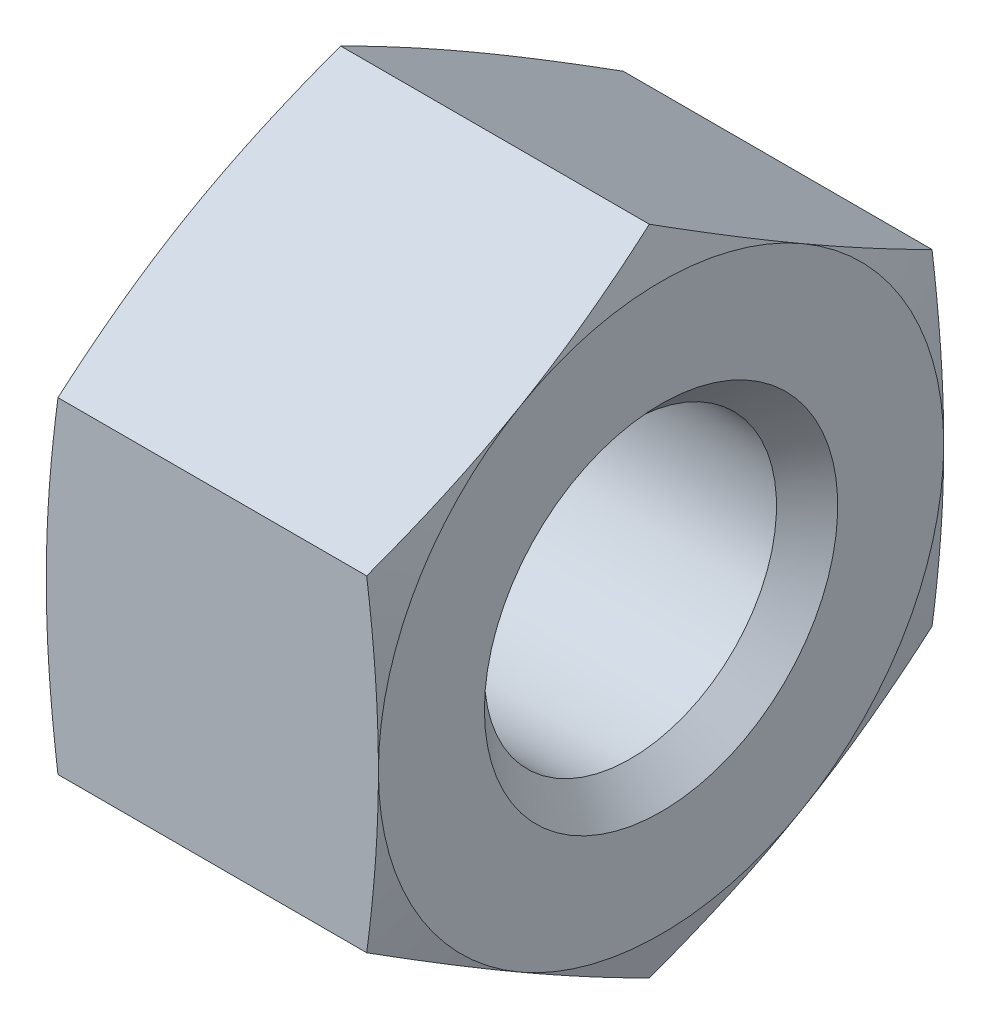
ISO-10303-21;
HEADER;
FILE_DESCRIPTION(('STEP AP214'),'2;1');
FILE_NAME('part.step','',(''),(''),'','','');
FILE_SCHEMA(('AUTOMOTIVE_DESIGN { 1 0 10303 214 1 1 1 1 }'));
ENDSEC;
DATA;
#1=APPLICATION_CONTEXT('core data for automotive mechanical design processes');
#2=APPLICATION_PROTOCOL_DEFINITION('international standard','automotive_design',2000,#1);
#3=PRODUCT_CONTEXT('',#1,'mechanical');
#4=PRODUCT('Part','Part','',(#3));
#5=PRODUCT_RELATED_PRODUCT_CATEGORY('part','',(#4));
#6=PRODUCT_DEFINITION_FORMATION('','',#4);
#7=PRODUCT_DEFINITION_CONTEXT('part definition',#1,'design');
#8=PRODUCT_DEFINITION('design','',#6,#7);
#9=PRODUCT_DEFINITION_SHAPE('','',#8);
#10=(LENGTH_UNIT() NAMED_UNIT(*) SI_UNIT(.MILLI.,.METRE.));
#11=(NAMED_UNIT(*) PLANE_ANGLE_UNIT() SI_UNIT($,.RADIAN.));
#12=(NAMED_UNIT(*) SI_UNIT($,.STERADIAN.) SOLID_ANGLE_UNIT());
#13=UNCERTAINTY_MEASURE_WITH_UNIT(LENGTH_MEASURE(1.E-05),#10,'distance_accuracy_value','');
#14=(GEOMETRIC_REPRESENTATION_CONTEXT(3) GLOBAL_UNCERTAINTY_ASSIGNED_CONTEXT((#13)) GLOBAL_UNIT_ASSIGNED_CONTEXT((#10,
#11,#12)) REPRESENTATION_CONTEXT('',''));
#15=CARTESIAN_POINT('',(0.,0.,0.));
#16=DIRECTION('',(0.,0.,1.));
#17=DIRECTION('',(1.,0.,0.));
#18=AXIS2_PLACEMENT_3D('',#15,#16,#17);
#19=CARTESIAN_POINT('',(-2.1356406460551,0.,0.));
#20=DIRECTION('',(1.,0.,0.));
#21=DIRECTION('',(0.,0.,-1.));
#22=AXIS2_PLACEMENT_3D('',#19,#20,#21);
#23=CONICAL_SURFACE('',#22,4.8,1.30899693899574);
#24=CARTESIAN_POINT('',(-2.18416152142258,-2.30928560670466,-4.0002));
#25=CARTESIAN_POINT('',(-2.20987303025889,-2.40519879285123,-3.83407348847834));
#26=CARTESIAN_POINT('',(-2.23321489853113,-2.50128588853265,-3.66764575680637));
#27=CARTESIAN_POINT('',(-2.2742244457158,-2.69379944202103,-3.33420250101888));
#28=CARTESIAN_POINT('',(-2.29188981954164,-2.79022602165644,-3.16718676589026));
#29=CARTESIAN_POINT('',(-2.32051501923542,-2.98283386677358,-2.83358019221101));
#30=CARTESIAN_POINT('',(-2.33150898419454,-3.07901382964741,-2.66699160984345));
#31=CARTESIAN_POINT('',(-2.34625077349233,-3.27149641829105,-2.33360198674029));
#32=CARTESIAN_POINT('',(-2.35,-3.3677990167144,-2.16680099337015));
#33=CARTESIAN_POINT('',(-2.35,-3.5604042135611,-1.83319900662985));
#34=CARTESIAN_POINT('',(-2.34625077349233,-3.65670681198445,-1.66639801325971));
#35=CARTESIAN_POINT('',(-2.33150898419454,-3.84918940062809,-1.33300839015655));
#36=CARTESIAN_POINT('',(-2.32051501923542,-3.94536936350192,-1.16641980778899));
#37=CARTESIAN_POINT('',(-2.29188981954164,-4.13797720861906,-0.832813234109737));
#38=CARTESIAN_POINT('',(-2.2742244457158,-4.23440378825447,-0.66579749898112));
#39=CARTESIAN_POINT('',(-2.23321489853113,-4.42691734174285,-0.332354243193627));
#40=CARTESIAN_POINT('',(-2.20987303025889,-4.52300443742427,-0.165926511521662));
#41=CARTESIAN_POINT('',(-2.18416152142258,-4.61891762357084,0.000199999999999763));
#42=B_SPLINE_CURVE_WITH_KNOTS('',3,(#24,#25,#26,#27,#28,#29,#30,#31,#32,#33,#34,#35,#36,#37,#38,
#39,#40,#41),.UNSPECIFIED.,.F.,.F.,(4,2,2,2,2,2,2,2,4),(0.,0.580655908162845,1.1615473094924,
1.73944052622642,2.31722188451987,2.89500324281333,3.47289645954735,4.0537878608769,
4.63444376903975),.UNSPECIFIED.);
#43=CARTESIAN_POINT('',(-2.35,-3.46410161513775,-2.));
#44=VERTEX_POINT('',#43);
#45=CARTESIAN_POINT('',(-2.18419246269048,-4.618802153517,0.));
#46=VERTEX_POINT('',#45);
#47=EDGE_CURVE('E331',#44,#46,#42,.T.);
#48=ORIENTED_EDGE('',*,*,#47,.T.);
#49=CARTESIAN_POINT('',(-2.18416152142258,-4.61891762357084,-0.000200000000000201));
#50=CARTESIAN_POINT('',(-2.20987303025889,-4.52300443742427,0.165926511521663));
#51=CARTESIAN_POINT('',(-2.23321489853113,-4.42691734174285,0.332354243193627));
#52=CARTESIAN_POINT('',(-2.2742244457158,-4.23440378825447,0.66579749898112));
#53=CARTESIAN_POINT('',(-2.29188981954164,-4.13797720861906,0.832813234109736));
#54=CARTESIAN_POINT('',(-2.32051501923542,-3.94536936350192,1.16641980778899));
#55=CARTESIAN_POINT('',(-2.33150898419454,-3.84918940062809,1.33300839015655));
#56=CARTESIAN_POINT('',(-2.34625077349233,-3.65670681198445,1.66639801325971));
#57=CARTESIAN_POINT('',(-2.35,-3.5604042135611,1.83319900662985));
#58=CARTESIAN_POINT('',(-2.35,-3.3677990167144,2.16680099337015));
#59=CARTESIAN_POINT('',(-2.34625077349233,-3.27149641829105,2.33360198674029));
#60=CARTESIAN_POINT('',(-2.33150898419454,-3.07901382964741,2.66699160984345));
#61=CARTESIAN_POINT('',(-2.32051501923542,-2.98283386677358,2.83358019221101));
#62=CARTESIAN_POINT('',(-2.29188981954164,-2.79022602165644,3.16718676589026));
#63=CARTESIAN_POINT('',(-2.2742244457158,-2.69379944202103,3.33420250101888));
#64=CARTESIAN_POINT('',(-2.23321489853113,-2.50128588853266,3.66764575680637));
#65=CARTESIAN_POINT('',(-2.20987303025889,-2.40519879285123,3.83407348847834));
#66=CARTESIAN_POINT('',(-2.18416152142258,-2.30928560670466,4.0002));
#67=B_SPLINE_CURVE_WITH_KNOTS('',3,(#49,#50,#51,#52,#53,#54,#55,#56,#57,#58,#59,#60,#61,#62,#63,
#64,#65,#66),.UNSPECIFIED.,.F.,.F.,(4,2,2,2,2,2,2,2,4),(0.,0.580655908162846,1.1615473094924,
1.73944052622642,2.31722188451987,2.89500324281333,3.47289645954735,4.0537878608769,
4.63444376903975),.UNSPECIFIED.);
#68=CARTESIAN_POINT('',(-2.35,-3.46410161513775,2.));
#69=VERTEX_POINT('',#68);
#70=EDGE_CURVE('E363',#46,#69,#67,.T.);
#71=ORIENTED_EDGE('',*,*,#70,.T.);
#72=CARTESIAN_POINT('',(-2.35,0.,0.));
#73=DIRECTION('',(-1.,0.,0.));
#74=DIRECTION('',(0.,0.,1.));
#75=AXIS2_PLACEMENT_3D('',#72,#73,#74);
#76=CIRCLE('',#75,4.);
#77=EDGE_CURVE('E257',#44,#69,#76,.T.);
#78=ORIENTED_EDGE('',*,*,#77,.F.);
#79=EDGE_LOOP('',(#48,#71,#78));
#80=FACE_BOUND('',#79,.T.);
#81=ADVANCED_FACE('F31',(#80),#23,.T.);
#82=CARTESIAN_POINT('',(-2.35,0.,4.));
#83=VERTEX_POINT('',#82);
#84=EDGE_CURVE('E251',#69,#83,#76,.T.);
#85=ORIENTED_EDGE('',*,*,#84,.F.);
#86=CARTESIAN_POINT('',(-2.18419246269048,-2.3094010767585,4.));
#87=VERTEX_POINT('',#86);
#88=EDGE_CURVE('E358',#69,#87,#67,.T.);
#89=ORIENTED_EDGE('',*,*,#88,.T.);
#90=CARTESIAN_POINT('',(-1.46517037802223,-6.10921843657188,4.));
#91=CARTESIAN_POINT('',(-1.50583975004685,-5.92774988323987,4.));
#92=CARTESIAN_POINT('',(-1.54601169740257,-5.74616790026257,4.));
#93=CARTESIAN_POINT('',(-1.62509233829767,-5.38272118580133,4.));
#94=CARTESIAN_POINT('',(-1.66400097727847,-5.20085644246028,4.));
#95=CARTESIAN_POINT('',(-1.74032045660653,-4.83662540480623,4.));
#96=CARTESIAN_POINT('',(-1.77772979025036,-4.65425879349873,4.));
#97=CARTESIAN_POINT('',(-1.85064649902307,-4.28914657904778,4.));
#98=CARTESIAN_POINT('',(-1.88615389020404,-4.10640097911646,4.));
#99=CARTESIAN_POINT('',(-1.95454084860502,-3.74192352777713,4.));
#100=CARTESIAN_POINT('',(-1.98743912365168,-3.56019522296839,4.));
#101=CARTESIAN_POINT('',(-2.05036100322091,-3.19624282089727,4.));
#102=CARTESIAN_POINT('',(-2.08038454111978,-3.01401871224495,4.));
#103=CARTESIAN_POINT('',(-2.16514837496081,-2.46654926383017,4.));
#104=CARTESIAN_POINT('',(-2.21459711870794,-2.10042861028541,4.));
#105=CARTESIAN_POINT('',(-2.27349019169773,-1.54749800614255,4.));
#106=CARTESIAN_POINT('',(-2.2906270077516,-1.36150502191324,4.));
#107=CARTESIAN_POINT('',(-2.31876025022576,-0.989048440515795,4.));
#108=CARTESIAN_POINT('',(-2.32975681746682,-0.802584854238993,4.));
#109=CARTESIAN_POINT('',(-2.34497151239788,-0.429461375014292,4.));
#110=CARTESIAN_POINT('',(-2.34919272046559,-0.24280160990552,4.));
#111=CARTESIAN_POINT('',(-2.35059625393057,0.130544972446153,4.));
#112=CARTESIAN_POINT('',(-2.3477785853955,0.317231789665596,4.));
#113=CARTESIAN_POINT('',(-2.33526316868402,0.691049259128634,4.));
#114=CARTESIAN_POINT('',(-2.32554044995826,0.878179058152002,4.));
#115=CARTESIAN_POINT('',(-2.29976944473966,1.25199847568159,4.));
#116=CARTESIAN_POINT('',(-2.28372101820215,1.43868808435039,4.));
#117=CARTESIAN_POINT('',(-2.2461108123462,1.81162605415967,4.));
#118=CARTESIAN_POINT('',(-2.22454543498588,1.9978740469773,4.));
#119=CARTESIAN_POINT('',(-2.1767929051206,2.36976909987765,4.));
#120=CARTESIAN_POINT('',(-2.150605738105,2.55541615807181,4.));
#121=CARTESIAN_POINT('',(-2.07011860296052,3.08694187083851,4.));
#122=CARTESIAN_POINT('',(-2.01113844049618,3.43210836286982,4.));
#123=CARTESIAN_POINT('',(-1.88444237269594,4.12083388395224,4.));
#124=CARTESIAN_POINT('',(-1.81672535964388,4.46439270343839,4.));
#125=CARTESIAN_POINT('',(-1.67542622190199,5.15037987222018,4.));
#126=CARTESIAN_POINT('',(-1.60184267736708,5.49280792683139,4.));
#127=CARTESIAN_POINT('',(-1.45068473297207,6.1767540733376,4.));
#128=CARTESIAN_POINT('',(-1.37311056656083,6.51827221723526,4.));
#129=CARTESIAN_POINT('',(-1.21593381501229,7.19730420929037,4.));
#130=CARTESIAN_POINT('',(-1.13635865260068,7.53482442870949,4.));
#131=CARTESIAN_POINT('',(-0.975215617800764,8.20939404508095,4.));
#132=CARTESIAN_POINT('',(-0.89364770910982,8.54644343333753,4.));
#133=CARTESIAN_POINT('',(-0.729141617535818,9.21976614262093,4.));
#134=CARTESIAN_POINT('',(-0.646205249827723,9.55603990806901,4.));
#135=CARTESIAN_POINT('',(-0.479200037251131,10.2282945236366,4.));
#136=CARTESIAN_POINT('',(-0.395131229845915,10.5642753830564,4.));
#137=CARTESIAN_POINT('',(-0.310661315196006,10.9001541610329,4.));
#138=B_SPLINE_CURVE_WITH_KNOTS('',3,(#90,#91,#92,#93,#94,#95,#96,#97,#98,#99,#100,#101,#102,
#103,#104,#105,#106,#107,#108,#109,#110,#111,#112,#113,#114,#115,#116,#117,#118,#119,#120,#121,
#122,#123,#124,#125,#126,#127,#128,#129,#130,#131,#132,#133,#134,#135,#136,#137),.UNSPECIFIED.,
.F.,.F.,(4,2,2,2,2,2,2,2,2,2,2,2,2,2,2,2,2,2,2,2,2,2,2,4),(0.,0.557912053411,1.11584816944025,
1.67433159202153,2.2328103003449,2.78683264220615,3.34086782074889,4.44869929654117,
5.00895954390097,5.56920694169661,6.1291995540447,6.68919168366778,7.25121927776488,
7.81325931527224,8.37566684236836,8.93807613523881,9.98838667207662,11.0388305053888,
12.0895293482849,13.1401667957016,14.1804801839177,15.2208125380847,16.2598610899637,
17.298875352129),.UNSPECIFIED.);
#139=EDGE_CURVE('E144',#87,#83,#138,.T.);
#140=ORIENTED_EDGE('',*,*,#139,.T.);
#141=EDGE_LOOP('',(#85,#89,#140));
#142=FACE_BOUND('',#141,.T.);
#143=ADVANCED_FACE('F295',(#142),#23,.T.);
#144=CARTESIAN_POINT('',(-2.35,3.46410161513775,2.));
#145=VERTEX_POINT('',#144);
#146=EDGE_CURVE('E248',#83,#145,#76,.T.);
#147=ORIENTED_EDGE('',*,*,#146,.F.);
#148=CARTESIAN_POINT('',(-2.18419246269048,2.3094010767585,4.));
#149=VERTEX_POINT('',#148);
#150=EDGE_CURVE('E148',#83,#149,#138,.T.);
#151=ORIENTED_EDGE('',*,*,#150,.T.);
#152=CARTESIAN_POINT('',(-2.18416152142258,2.30928560670466,4.0002));
#153=CARTESIAN_POINT('',(-2.20987303025889,2.40519879285123,3.83407348847834));
#154=CARTESIAN_POINT('',(-2.23321489853113,2.50128588853265,3.66764575680637));
#155=CARTESIAN_POINT('',(-2.2742244457158,2.69379944202103,3.33420250101888));
#156=CARTESIAN_POINT('',(-2.29188981954164,2.79022602165644,3.16718676589026));
#157=CARTESIAN_POINT('',(-2.32051501923542,2.98283386677358,2.83358019221101));
#158=CARTESIAN_POINT('',(-2.33150898419454,3.07901382964741,2.66699160984345));
#159=CARTESIAN_POINT('',(-2.34625077349233,3.27149641829105,2.33360198674029));
#160=CARTESIAN_POINT('',(-2.35,3.3677990167144,2.16680099337015));
#161=CARTESIAN_POINT('',(-2.35,3.5604042135611,1.83319900662985));
#162=CARTESIAN_POINT('',(-2.34625077349233,3.65670681198445,1.66639801325971));
#163=CARTESIAN_POINT('',(-2.33150898419454,3.84918940062809,1.33300839015655));
#164=CARTESIAN_POINT('',(-2.32051501923542,3.94536936350192,1.16641980778899));
#165=CARTESIAN_POINT('',(-2.29188981954164,4.13797720861906,0.832813234109737));
#166=CARTESIAN_POINT('',(-2.2742244457158,4.23440378825447,0.66579749898112));
#167=CARTESIAN_POINT('',(-2.23321489853113,4.42691734174285,0.332354243193627));
#168=CARTESIAN_POINT('',(-2.20987303025889,4.52300443742427,0.165926511521662));
#169=CARTESIAN_POINT('',(-2.18416152142258,4.61891762357084,-0.000199999999999763));
#170=B_SPLINE_CURVE_WITH_KNOTS('',3,(#152,#153,#154,#155,#156,#157,#158,#159,#160,#161,#162,
#163,#164,#165,#166,#167,#168,#169),.UNSPECIFIED.,.F.,.F.,(4,2,2,2,2,2,2,2,4),(0.,
0.580655908162845,1.1615473094924,1.73944052622642,2.31722188451987,2.89500324281333,
3.47289645954735,4.0537878608769,4.63444376903975),.UNSPECIFIED.);
#171=EDGE_CURVE('E143',#149,#145,#170,.T.);
#172=ORIENTED_EDGE('',*,*,#171,.T.);
#173=EDGE_LOOP('',(#147,#151,#172));
#174=FACE_BOUND('',#173,.T.);
#175=ADVANCED_FACE('F300',(#174),#23,.T.);
#176=CARTESIAN_POINT('',(-1.46517037802223,-6.10921843657188,-4.));
#177=CARTESIAN_POINT('',(-1.50583975004685,-5.92774988323987,-4.));
#178=CARTESIAN_POINT('',(-1.54601169740257,-5.74616790026257,-4.));
#179=CARTESIAN_POINT('',(-1.62509233829767,-5.38272118580133,-4.));
#180=CARTESIAN_POINT('',(-1.66400097727847,-5.20085644246028,-4.));
#181=CARTESIAN_POINT('',(-1.74032045660653,-4.83662540480623,-4.));
#182=CARTESIAN_POINT('',(-1.77772979025036,-4.65425879349873,-4.));
#183=CARTESIAN_POINT('',(-1.85064649902307,-4.28914657904778,-4.));
#184=CARTESIAN_POINT('',(-1.88615389020404,-4.10640097911646,-4.));
#185=CARTESIAN_POINT('',(-1.95454084860502,-3.74192352777713,-4.));
#186=CARTESIAN_POINT('',(-1.98743912365168,-3.56019522296839,-4.));
#187=CARTESIAN_POINT('',(-2.05036100322091,-3.19624282089727,-4.));
#188=CARTESIAN_POINT('',(-2.08038454111978,-3.01401871224495,-4.));
#189=CARTESIAN_POINT('',(-2.16514837496081,-2.46654926383017,-4.));
#190=CARTESIAN_POINT('',(-2.21459711870794,-2.10042861028541,-4.));
#191=CARTESIAN_POINT('',(-2.27349019169773,-1.54749800614255,-4.));
#192=CARTESIAN_POINT('',(-2.2906270077516,-1.36150502191324,-4.));
#193=CARTESIAN_POINT('',(-2.31876025022576,-0.989048440515795,-4.));
#194=CARTESIAN_POINT('',(-2.32975681746682,-0.802584854238993,-4.));
#195=CARTESIAN_POINT('',(-2.34497151239788,-0.429461375014292,-4.));
#196=CARTESIAN_POINT('',(-2.34919272046559,-0.24280160990552,-4.));
#197=CARTESIAN_POINT('',(-2.35059625393057,0.130544972446153,-4.));
#198=CARTESIAN_POINT('',(-2.3477785853955,0.317231789665596,-4.));
#199=CARTESIAN_POINT('',(-2.33526316868402,0.691049259128634,-4.));
#200=CARTESIAN_POINT('',(-2.32554044995826,0.878179058152002,-4.));
#201=CARTESIAN_POINT('',(-2.29976944473966,1.25199847568159,-4.));
#202=CARTESIAN_POINT('',(-2.28372101820215,1.43868808435039,-4.));
#203=CARTESIAN_POINT('',(-2.2461108123462,1.81162605415967,-4.));
#204=CARTESIAN_POINT('',(-2.22454543498588,1.9978740469773,-4.));
#205=CARTESIAN_POINT('',(-2.1767929051206,2.36976909987765,-4.));
#206=CARTESIAN_POINT('',(-2.150605738105,2.55541615807181,-4.));
#207=CARTESIAN_POINT('',(-2.07011860296052,3.08694187083851,-4.));
#208=CARTESIAN_POINT('',(-2.01113844049618,3.43210836286982,-4.));
#209=CARTESIAN_POINT('',(-1.88444237269594,4.12083388395224,-4.));
#210=CARTESIAN_POINT('',(-1.81672535964388,4.46439270343839,-4.));
#211=CARTESIAN_POINT('',(-1.67542622190199,5.15037987222018,-4.));
#212=CARTESIAN_POINT('',(-1.60184267736708,5.49280792683139,-4.));
#213=CARTESIAN_POINT('',(-1.45068473297207,6.1767540733376,-4.));
#214=CARTESIAN_POINT('',(-1.37311056656083,6.51827221723526,-4.));
#215=CARTESIAN_POINT('',(-1.21593381501229,7.19730420929037,-4.));
#216=CARTESIAN_POINT('',(-1.13635865260068,7.53482442870949,-4.));
#217=CARTESIAN_POINT('',(-0.975215617800764,8.20939404508095,-4.));
#218=CARTESIAN_POINT('',(-0.89364770910982,8.54644343333753,-4.));
#219=CARTESIAN_POINT('',(-0.729141617535818,9.21976614262093,-4.));
#220=CARTESIAN_POINT('',(-0.646205249827723,9.55603990806901,-4.));
#221=CARTESIAN_POINT('',(-0.479200037251131,10.2282945236366,-4.));
#222=CARTESIAN_POINT('',(-0.395131229845915,10.5642753830564,-4.));
#223=CARTESIAN_POINT('',(-0.310661315196006,10.9001541610329,-4.));
#224=B_SPLINE_CURVE_WITH_KNOTS('',3,(#176,#177,#178,#179,#180,#181,#182,#183,#184,#185,#186,
#187,#188,#189,#190,#191,#192,#193,#194,#195,#196,#197,#198,#199,#200,#201,#202,#203,#204,#205,
#206,#207,#208,#209,#210,#211,#212,#213,#214,#215,#216,#217,#218,#219,#220,#221,#222,#223),
.UNSPECIFIED.,.F.,.F.,(4,2,2,2,2,2,2,2,2,2,2,2,2,2,2,2,2,2,2,2,2,2,2,4),(0.,0.557912053411,
1.11584816944025,1.67433159202153,2.2328103003449,2.78683264220615,3.34086782074889,
4.44869929654117,5.00895954390097,5.56920694169661,6.1291995540447,6.68919168366778,
7.25121927776488,7.81325931527224,8.37566684236836,8.93807613523881,9.98838667207662,
11.0388305053888,12.0895293482849,13.1401667957016,14.1804801839177,15.2208125380847,
16.2598610899637,17.298875352129),.UNSPECIFIED.);
#225=CARTESIAN_POINT('',(-2.35,0.,-4.));
#226=VERTEX_POINT('',#225);
#227=CARTESIAN_POINT('',(-2.18419246269048,-2.3094010767585,-4.));
#228=VERTEX_POINT('',#227);
#229=EDGE_CURVE('E130',#226,#228,#224,.F.);
#230=ORIENTED_EDGE('',*,*,#229,.T.);
#231=EDGE_CURVE('E322',#228,#44,#42,.T.);
#232=ORIENTED_EDGE('',*,*,#231,.T.);
#233=EDGE_CURVE('E261',#226,#44,#76,.T.);
#234=ORIENTED_EDGE('',*,*,#233,.F.);
#235=EDGE_LOOP('',(#230,#232,#234));
#236=FACE_BOUND('',#235,.T.);
#237=ADVANCED_FACE('F308',(#236),#23,.T.);
#238=CARTESIAN_POINT('',(-2.35,3.46410161513775,-2.));
#239=VERTEX_POINT('',#238);
#240=EDGE_CURVE('E141',#145,#239,#76,.T.);
#241=ORIENTED_EDGE('',*,*,#240,.F.);
#242=CARTESIAN_POINT('',(-2.18419246269048,4.618802153517,0.));
#243=VERTEX_POINT('',#242);
#244=EDGE_CURVE('E135',#145,#243,#170,.T.);
#245=ORIENTED_EDGE('',*,*,#244,.T.);
#246=CARTESIAN_POINT('',(-2.18416152142258,4.61891762357084,0.000200000000000201));
#247=CARTESIAN_POINT('',(-2.20987303025889,4.52300443742427,-0.165926511521663));
#248=CARTESIAN_POINT('',(-2.23321489853113,4.42691734174285,-0.332354243193627));
#249=CARTESIAN_POINT('',(-2.2742244457158,4.23440378825447,-0.66579749898112));
#250=CARTESIAN_POINT('',(-2.29188981954164,4.13797720861906,-0.832813234109736));
#251=CARTESIAN_POINT('',(-2.32051501923542,3.94536936350192,-1.16641980778899));
#252=CARTESIAN_POINT('',(-2.33150898419454,3.84918940062809,-1.33300839015655));
#253=CARTESIAN_POINT('',(-2.34625077349233,3.65670681198445,-1.66639801325971));
#254=CARTESIAN_POINT('',(-2.35,3.5604042135611,-1.83319900662985));
#255=CARTESIAN_POINT('',(-2.35,3.3677990167144,-2.16680099337015));
#256=CARTESIAN_POINT('',(-2.34625077349233,3.27149641829105,-2.33360198674029));
#257=CARTESIAN_POINT('',(-2.33150898419454,3.07901382964741,-2.66699160984345));
#258=CARTESIAN_POINT('',(-2.32051501923542,2.98283386677358,-2.83358019221101));
#259=CARTESIAN_POINT('',(-2.29188981954164,2.79022602165644,-3.16718676589026));
#260=CARTESIAN_POINT('',(-2.2742244457158,2.69379944202103,-3.33420250101888));
#261=CARTESIAN_POINT('',(-2.23321489853113,2.50128588853266,-3.66764575680637));
#262=CARTESIAN_POINT('',(-2.20987303025889,2.40519879285123,-3.83407348847834));
#263=CARTESIAN_POINT('',(-2.18416152142258,2.30928560670466,-4.0002));
#264=B_SPLINE_CURVE_WITH_KNOTS('',3,(#246,#247,#248,#249,#250,#251,#252,#253,#254,#255,#256,
#257,#258,#259,#260,#261,#262,#263),.UNSPECIFIED.,.F.,.F.,(4,2,2,2,2,2,2,2,4),(0.,
0.580655908162846,1.1615473094924,1.73944052622642,2.31722188451987,2.89500324281333,
3.47289645954735,4.0537878608769,4.63444376903975),.UNSPECIFIED.);
#265=EDGE_CURVE('E122',#243,#239,#264,.T.);
#266=ORIENTED_EDGE('',*,*,#265,.T.);
#267=EDGE_LOOP('',(#241,#245,#266));
#268=FACE_BOUND('',#267,.T.);
#269=ADVANCED_FACE('F139',(#268),#23,.T.);
#270=CARTESIAN_POINT('',(2.35,0.,0.));
#271=DIRECTION('',(-1.,0.,0.));
#272=DIRECTION('',(0.,0.,1.));
#273=AXIS2_PLACEMENT_3D('',#270,#271,#272);
#274=CONICAL_SURFACE('',#273,4.,1.30899693899574);
#275=CARTESIAN_POINT('',(2.18416152142258,2.30928560670466,-4.0002));
#276=CARTESIAN_POINT('',(2.20987303025889,2.40519879285123,-3.83407348847834));
#277=CARTESIAN_POINT('',(2.23321489853113,2.50128588853266,-3.66764575680637));
#278=CARTESIAN_POINT('',(2.2742244457158,2.69379944202103,-3.33420250101888));
#279=CARTESIAN_POINT('',(2.29188981954164,2.79022602165644,-3.16718676589026));
#280=CARTESIAN_POINT('',(2.32051501923542,2.98283386677358,-2.83358019221101));
#281=CARTESIAN_POINT('',(2.33150898419454,3.07901382964741,-2.66699160984345));
#282=CARTESIAN_POINT('',(2.34625077349233,3.27149641829105,-2.33360198674029));
#283=CARTESIAN_POINT('',(2.35,3.3677990167144,-2.16680099337015));
#284=CARTESIAN_POINT('',(2.35,3.5604042135611,-1.83319900662985));
#285=CARTESIAN_POINT('',(2.34625077349233,3.65670681198445,-1.66639801325971));
#286=CARTESIAN_POINT('',(2.33150898419454,3.84918940062809,-1.33300839015655));
#287=CARTESIAN_POINT('',(2.32051501923542,3.94536936350192,-1.16641980778899));
#288=CARTESIAN_POINT('',(2.29188981954164,4.13797720861906,-0.832813234109737));
#289=CARTESIAN_POINT('',(2.2742244457158,4.23440378825447,-0.66579749898112));
#290=CARTESIAN_POINT('',(2.23321489853113,4.42691734174285,-0.332354243193628));
#291=CARTESIAN_POINT('',(2.20987303025889,4.52300443742427,-0.165926511521663));
#292=CARTESIAN_POINT('',(2.18416152142258,4.61891762357084,0.000200000000000154));
#293=B_SPLINE_CURVE_WITH_KNOTS('',3,(#275,#276,#277,#278,#279,#280,#281,#282,#283,#284,#285,
#286,#287,#288,#289,#290,#291,#292),.UNSPECIFIED.,.F.,.F.,(4,2,2,2,2,2,2,2,4),(0.,
0.580655908162846,1.1615473094924,1.73944052622642,2.31722188451988,2.89500324281333,
3.47289645954735,4.0537878608769,4.63444376903975),.UNSPECIFIED.);
#294=CARTESIAN_POINT('',(2.35,3.46410161513775,-2.));
#295=VERTEX_POINT('',#294);
#296=CARTESIAN_POINT('',(2.18419246269048,4.618802153517,0.));
#297=VERTEX_POINT('',#296);
#298=EDGE_CURVE('E193',#295,#297,#293,.T.);
#299=ORIENTED_EDGE('',*,*,#298,.T.);
#300=CARTESIAN_POINT('',(2.18416152142258,4.61891762357084,-0.00020000000000007));
#301=CARTESIAN_POINT('',(2.20987303025889,4.52300443742427,0.165926511521662));
#302=CARTESIAN_POINT('',(2.23321489853113,4.42691734174285,0.332354243193627));
#303=CARTESIAN_POINT('',(2.2742244457158,4.23440378825447,0.66579749898112));
#304=CARTESIAN_POINT('',(2.29188981954164,4.13797720861906,0.832813234109737));
#305=CARTESIAN_POINT('',(2.32051501923542,3.94536936350192,1.16641980778899));
#306=CARTESIAN_POINT('',(2.33150898419454,3.84918940062809,1.33300839015655));
#307=CARTESIAN_POINT('',(2.34625077349233,3.65670681198445,1.66639801325971));
#308=CARTESIAN_POINT('',(2.35,3.5604042135611,1.83319900662985));
#309=CARTESIAN_POINT('',(2.35,3.3677990167144,2.16680099337015));
#310=CARTESIAN_POINT('',(2.34625077349233,3.27149641829105,2.33360198674029));
#311=CARTESIAN_POINT('',(2.33150898419454,3.07901382964741,2.66699160984345));
#312=CARTESIAN_POINT('',(2.32051501923542,2.98283386677358,2.83358019221101));
#313=CARTESIAN_POINT('',(2.29188981954164,2.79022602165644,3.16718676589026));
#314=CARTESIAN_POINT('',(2.2742244457158,2.69379944202103,3.33420250101888));
#315=CARTESIAN_POINT('',(2.23321489853113,2.50128588853266,3.66764575680637));
#316=CARTESIAN_POINT('',(2.20987303025889,2.40519879285123,3.83407348847834));
#317=CARTESIAN_POINT('',(2.18416152142258,2.30928560670466,4.0002));
#318=B_SPLINE_CURVE_WITH_KNOTS('',3,(#300,#301,#302,#303,#304,#305,#306,#307,#308,#309,#310,
#311,#312,#313,#314,#315,#316,#317),.UNSPECIFIED.,.F.,.F.,(4,2,2,2,2,2,2,2,4),(0.,
0.580655908162846,1.1615473094924,1.73944052622642,2.31722188451987,2.89500324281333,
3.47289645954735,4.0537878608769,4.63444376903975),.UNSPECIFIED.);
#319=CARTESIAN_POINT('',(2.35,3.46410161513775,2.));
#320=VERTEX_POINT('',#319);
#321=EDGE_CURVE('E11',#297,#320,#318,.T.);
#322=ORIENTED_EDGE('',*,*,#321,.T.);
#323=CARTESIAN_POINT('',(2.35,0.,0.));
#324=DIRECTION('',(-1.,0.,0.));
#325=DIRECTION('',(0.,0.,1.));
#326=AXIS2_PLACEMENT_3D('',#323,#324,#325);
#327=CIRCLE('',#326,4.);
#328=EDGE_CURVE('E263',#320,#295,#327,.T.);
#329=ORIENTED_EDGE('',*,*,#328,.T.);
#330=EDGE_LOOP('',(#299,#322,#329));
#331=FACE_BOUND('',#330,.T.);
#332=ADVANCED_FACE('F188',(#331),#274,.T.);
#333=CARTESIAN_POINT('',(2.35,0.,4.));
#334=VERTEX_POINT('',#333);
#335=EDGE_CURVE('E258',#334,#320,#327,.T.);
#336=ORIENTED_EDGE('',*,*,#335,.T.);
#337=CARTESIAN_POINT('',(2.18419246269048,2.3094010767585,4.));
#338=VERTEX_POINT('',#337);
#339=EDGE_CURVE('E35',#320,#338,#318,.T.);
#340=ORIENTED_EDGE('',*,*,#339,.T.);
#341=CARTESIAN_POINT('',(1.46517037802223,-6.10921843657188,4.));
#342=CARTESIAN_POINT('',(1.50583975004685,-5.92774988323987,4.));
#343=CARTESIAN_POINT('',(1.54601169740257,-5.74616790026257,4.));
#344=CARTESIAN_POINT('',(1.62509233829767,-5.38272118580133,4.));
#345=CARTESIAN_POINT('',(1.66400097727847,-5.20085644246028,4.));
#346=CARTESIAN_POINT('',(1.74032045660653,-4.83662540480623,4.));
#347=CARTESIAN_POINT('',(1.77772979025036,-4.65425879349873,4.));
#348=CARTESIAN_POINT('',(1.85064649902307,-4.28914657904778,4.));
#349=CARTESIAN_POINT('',(1.88615389020403,-4.10640097911646,4.));
#350=CARTESIAN_POINT('',(1.95454084860502,-3.74192352777713,4.));
#351=CARTESIAN_POINT('',(1.98743912365168,-3.56019522296839,4.));
#352=CARTESIAN_POINT('',(2.05036100322091,-3.19624282089727,4.));
#353=CARTESIAN_POINT('',(2.08038454111978,-3.01401871224495,4.));
#354=CARTESIAN_POINT('',(2.16514837496081,-2.46654926383017,4.));
#355=CARTESIAN_POINT('',(2.21459711870794,-2.10042861028541,4.));
#356=CARTESIAN_POINT('',(2.27349019169773,-1.54749800614255,4.));
#357=CARTESIAN_POINT('',(2.2906270077516,-1.36150502191324,4.));
#358=CARTESIAN_POINT('',(2.31876025022576,-0.989048440515794,4.));
#359=CARTESIAN_POINT('',(2.32975681746682,-0.802584854238992,4.));
#360=CARTESIAN_POINT('',(2.34497151239788,-0.429461375014291,4.));
#361=CARTESIAN_POINT('',(2.34919272046559,-0.242801609905519,4.));
#362=CARTESIAN_POINT('',(2.35059625393057,0.130544972446155,4.));
#363=CARTESIAN_POINT('',(2.3477785853955,0.317231789665597,4.));
#364=CARTESIAN_POINT('',(2.33526316868402,0.691049259128635,4.));
#365=CARTESIAN_POINT('',(2.32554044995826,0.878179058152004,4.));
#366=CARTESIAN_POINT('',(2.29976944473966,1.25199847568159,4.));
#367=CARTESIAN_POINT('',(2.28372101820215,1.43868808435039,4.));
#368=CARTESIAN_POINT('',(2.2461108123462,1.81162605415967,4.));
#369=CARTESIAN_POINT('',(2.22454543498588,1.9978740469773,4.));
#370=CARTESIAN_POINT('',(2.1767929051206,2.36976909987765,4.));
#371=CARTESIAN_POINT('',(2.15060573810499,2.55541615807182,4.));
#372=CARTESIAN_POINT('',(2.07011860296052,3.08694187083851,4.));
#373=CARTESIAN_POINT('',(2.01113844049618,3.43210836286982,4.));
#374=CARTESIAN_POINT('',(1.88444237269594,4.12083388395224,4.));
#375=CARTESIAN_POINT('',(1.81672535964388,4.46439270343839,4.));
#376=CARTESIAN_POINT('',(1.67542622190199,5.15037987222018,4.));
#377=CARTESIAN_POINT('',(1.60184267736708,5.49280792683139,4.));
#378=CARTESIAN_POINT('',(1.45068473297207,6.1767540733376,4.));
#379=CARTESIAN_POINT('',(1.37311056656083,6.51827221723526,4.));
#380=CARTESIAN_POINT('',(1.21593381501229,7.19730420929037,4.));
#381=CARTESIAN_POINT('',(1.13635865260068,7.53482442870949,4.));
#382=CARTESIAN_POINT('',(0.975215617800764,8.20939404508095,4.));
#383=CARTESIAN_POINT('',(0.89364770910982,8.54644343333753,4.));
#384=CARTESIAN_POINT('',(0.729141617535818,9.21976614262093,4.));
#385=CARTESIAN_POINT('',(0.646205249827723,9.55603990806901,4.));
#386=CARTESIAN_POINT('',(0.47920003725113,10.2282945236366,4.));
#387=CARTESIAN_POINT('',(0.395131229845914,10.5642753830564,4.));
#388=CARTESIAN_POINT('',(0.310661315196006,10.9001541610329,4.));
#389=B_SPLINE_CURVE_WITH_KNOTS('',3,(#341,#342,#343,#344,#345,#346,#347,#348,#349,#350,#351,
#352,#353,#354,#355,#356,#357,#358,#359,#360,#361,#362,#363,#364,#365,#366,#367,#368,#369,#370,
#371,#372,#373,#374,#375,#376,#377,#378,#379,#380,#381,#382,#383,#384,#385,#386,#387,#388),
.UNSPECIFIED.,.F.,.F.,(4,2,2,2,2,2,2,2,2,2,2,2,2,2,2,2,2,2,2,2,2,2,2,4),(0.,0.557912053411001,
1.11584816944025,1.67433159202153,2.2328103003449,2.78683264220615,3.34086782074889,
4.44869929654118,5.00895954390097,5.56920694169661,6.1291995540447,6.68919168366778,
7.25121927776489,7.81325931527224,8.37566684236836,8.93807613523881,9.98838667207662,
11.0388305053888,12.0895293482849,13.1401667957016,14.1804801839177,15.2208125380847,
16.2598610899637,17.298875352129),.UNSPECIFIED.);
#390=EDGE_CURVE('E224',#338,#334,#389,.F.);
#391=ORIENTED_EDGE('',*,*,#390,.T.);
#392=EDGE_LOOP('',(#336,#340,#391));
#393=FACE_BOUND('',#392,.T.);
#394=ADVANCED_FACE('F313',(#393),#274,.T.);
#395=CARTESIAN_POINT('',(2.35,-3.46410161513775,2.));
#396=VERTEX_POINT('',#395);
#397=EDGE_CURVE('E264',#396,#334,#327,.T.);
#398=ORIENTED_EDGE('',*,*,#397,.T.);
#399=CARTESIAN_POINT('',(2.18419246269048,-2.3094010767585,4.));
#400=VERTEX_POINT('',#399);
#401=EDGE_CURVE('E219',#334,#400,#389,.F.);
#402=ORIENTED_EDGE('',*,*,#401,.T.);
#403=CARTESIAN_POINT('',(2.18416152142258,-2.30928560670466,4.0002));
#404=CARTESIAN_POINT('',(2.20987303025889,-2.40519879285123,3.83407348847834));
#405=CARTESIAN_POINT('',(2.23321489853113,-2.50128588853266,3.66764575680637));
#406=CARTESIAN_POINT('',(2.2742244457158,-2.69379944202103,3.33420250101888));
#407=CARTESIAN_POINT('',(2.29188981954164,-2.79022602165644,3.16718676589026));
#408=CARTESIAN_POINT('',(2.32051501923542,-2.98283386677358,2.83358019221101));
#409=CARTESIAN_POINT('',(2.33150898419454,-3.07901382964741,2.66699160984345));
#410=CARTESIAN_POINT('',(2.34625077349233,-3.27149641829105,2.33360198674029));
#411=CARTESIAN_POINT('',(2.35,-3.3677990167144,2.16680099337015));
#412=CARTESIAN_POINT('',(2.35,-3.5604042135611,1.83319900662985));
#413=CARTESIAN_POINT('',(2.34625077349233,-3.65670681198445,1.66639801325971));
#414=CARTESIAN_POINT('',(2.33150898419454,-3.84918940062809,1.33300839015655));
#415=CARTESIAN_POINT('',(2.32051501923542,-3.94536936350192,1.16641980778899));
#416=CARTESIAN_POINT('',(2.29188981954164,-4.13797720861906,0.832813234109737));
#417=CARTESIAN_POINT('',(2.2742244457158,-4.23440378825447,0.66579749898112));
#418=CARTESIAN_POINT('',(2.23321489853113,-4.42691734174285,0.332354243193628));
#419=CARTESIAN_POINT('',(2.20987303025889,-4.52300443742427,0.165926511521663));
#420=CARTESIAN_POINT('',(2.18416152142258,-4.61891762357084,-0.000200000000000154));
#421=B_SPLINE_CURVE_WITH_KNOTS('',3,(#403,#404,#405,#406,#407,#408,#409,#410,#411,#412,#413,
#414,#415,#416,#417,#418,#419,#420),.UNSPECIFIED.,.F.,.F.,(4,2,2,2,2,2,2,2,4),(0.,
0.580655908162846,1.1615473094924,1.73944052622642,2.31722188451988,2.89500324281333,
3.47289645954735,4.0537878608769,4.63444376903975),.UNSPECIFIED.);
#422=EDGE_CURVE('E225',#400,#396,#421,.T.);
#423=ORIENTED_EDGE('',*,*,#422,.T.);
#424=EDGE_LOOP('',(#398,#402,#423));
#425=FACE_BOUND('',#424,.T.);
#426=ADVANCED_FACE('F382',(#425),#274,.T.);
#427=CARTESIAN_POINT('',(2.35,-3.46410161513775,-2.));
#428=VERTEX_POINT('',#427);
#429=EDGE_CURVE('E270',#428,#396,#327,.T.);
#430=ORIENTED_EDGE('',*,*,#429,.T.);
#431=CARTESIAN_POINT('',(2.18419246269048,-4.618802153517,0.));
#432=VERTEX_POINT('',#431);
#433=EDGE_CURVE('E215',#396,#432,#421,.T.);
#434=ORIENTED_EDGE('',*,*,#433,.T.);
#435=CARTESIAN_POINT('',(2.18416152142258,-4.61891762357084,0.00020000000000007));
#436=CARTESIAN_POINT('',(2.20987303025889,-4.52300443742427,-0.165926511521662));
#437=CARTESIAN_POINT('',(2.23321489853113,-4.42691734174285,-0.332354243193627));
#438=CARTESIAN_POINT('',(2.2742244457158,-4.23440378825447,-0.66579749898112));
#439=CARTESIAN_POINT('',(2.29188981954164,-4.13797720861906,-0.832813234109737));
#440=CARTESIAN_POINT('',(2.32051501923542,-3.94536936350192,-1.16641980778899));
#441=CARTESIAN_POINT('',(2.33150898419454,-3.84918940062809,-1.33300839015655));
#442=CARTESIAN_POINT('',(2.34625077349233,-3.65670681198445,-1.66639801325971));
#443=CARTESIAN_POINT('',(2.35,-3.5604042135611,-1.83319900662985));
#444=CARTESIAN_POINT('',(2.35,-3.3677990167144,-2.16680099337015));
#445=CARTESIAN_POINT('',(2.34625077349233,-3.27149641829105,-2.33360198674029));
#446=CARTESIAN_POINT('',(2.33150898419454,-3.07901382964741,-2.66699160984345));
#447=CARTESIAN_POINT('',(2.32051501923542,-2.98283386677358,-2.83358019221101));
#448=CARTESIAN_POINT('',(2.29188981954164,-2.79022602165644,-3.16718676589026));
#449=CARTESIAN_POINT('',(2.2742244457158,-2.69379944202103,-3.33420250101888));
#450=CARTESIAN_POINT('',(2.23321489853113,-2.50128588853266,-3.66764575680637));
#451=CARTESIAN_POINT('',(2.20987303025889,-2.40519879285123,-3.83407348847834));
#452=CARTESIAN_POINT('',(2.18416152142258,-2.30928560670466,-4.0002));
#453=B_SPLINE_CURVE_WITH_KNOTS('',3,(#435,#436,#437,#438,#439,#440,#441,#442,#443,#444,#445,
#446,#447,#448,#449,#450,#451,#452),.UNSPECIFIED.,.F.,.F.,(4,2,2,2,2,2,2,2,4),(0.,
0.580655908162846,1.1615473094924,1.73944052622642,2.31722188451987,2.89500324281333,
3.47289645954735,4.0537878608769,4.63444376903975),.UNSPECIFIED.);
#454=EDGE_CURVE('E232',#432,#428,#453,.T.);
#455=ORIENTED_EDGE('',*,*,#454,.T.);
#456=EDGE_LOOP('',(#430,#434,#455));
#457=FACE_BOUND('',#456,.T.);
#458=ADVANCED_FACE('F293',(#457),#274,.T.);
#459=CARTESIAN_POINT('',(2.35,0.,-4.));
#460=VERTEX_POINT('',#459);
#461=EDGE_CURVE('E272',#460,#428,#327,.T.);
#462=ORIENTED_EDGE('',*,*,#461,.T.);
#463=CARTESIAN_POINT('',(2.18419246269048,-2.3094010767585,-4.));
#464=VERTEX_POINT('',#463);
#465=EDGE_CURVE('E209',#428,#464,#453,.T.);
#466=ORIENTED_EDGE('',*,*,#465,.T.);
#467=CARTESIAN_POINT('',(1.46517037802223,-6.10921843657188,-4.));
#468=CARTESIAN_POINT('',(1.50583975004685,-5.92774988323987,-4.));
#469=CARTESIAN_POINT('',(1.54601169740257,-5.74616790026257,-4.));
#470=CARTESIAN_POINT('',(1.62509233829767,-5.38272118580133,-4.));
#471=CARTESIAN_POINT('',(1.66400097727847,-5.20085644246028,-4.));
#472=CARTESIAN_POINT('',(1.74032045660653,-4.83662540480623,-4.));
#473=CARTESIAN_POINT('',(1.77772979025036,-4.65425879349873,-4.));
#474=CARTESIAN_POINT('',(1.85064649902307,-4.28914657904778,-4.));
#475=CARTESIAN_POINT('',(1.88615389020403,-4.10640097911646,-4.));
#476=CARTESIAN_POINT('',(1.95454084860502,-3.74192352777713,-4.));
#477=CARTESIAN_POINT('',(1.98743912365168,-3.56019522296839,-4.));
#478=CARTESIAN_POINT('',(2.05036100322091,-3.19624282089727,-4.));
#479=CARTESIAN_POINT('',(2.08038454111978,-3.01401871224495,-4.));
#480=CARTESIAN_POINT('',(2.16514837496081,-2.46654926383017,-4.));
#481=CARTESIAN_POINT('',(2.21459711870794,-2.10042861028541,-4.));
#482=CARTESIAN_POINT('',(2.27349019169773,-1.54749800614255,-4.));
#483=CARTESIAN_POINT('',(2.2906270077516,-1.36150502191324,-4.));
#484=CARTESIAN_POINT('',(2.31876025022576,-0.989048440515794,-4.));
#485=CARTESIAN_POINT('',(2.32975681746682,-0.802584854238992,-4.));
#486=CARTESIAN_POINT('',(2.34497151239788,-0.429461375014291,-4.));
#487=CARTESIAN_POINT('',(2.34919272046559,-0.242801609905519,-4.));
#488=CARTESIAN_POINT('',(2.35059625393057,0.130544972446155,-4.));
#489=CARTESIAN_POINT('',(2.3477785853955,0.317231789665597,-4.));
#490=CARTESIAN_POINT('',(2.33526316868402,0.691049259128635,-4.));
#491=CARTESIAN_POINT('',(2.32554044995826,0.878179058152004,-4.));
#492=CARTESIAN_POINT('',(2.29976944473966,1.25199847568159,-4.));
#493=CARTESIAN_POINT('',(2.28372101820215,1.43868808435039,-4.));
#494=CARTESIAN_POINT('',(2.2461108123462,1.81162605415967,-4.));
#495=CARTESIAN_POINT('',(2.22454543498588,1.9978740469773,-4.));
#496=CARTESIAN_POINT('',(2.1767929051206,2.36976909987765,-4.));
#497=CARTESIAN_POINT('',(2.15060573810499,2.55541615807182,-4.));
#498=CARTESIAN_POINT('',(2.07011860296052,3.08694187083851,-4.));
#499=CARTESIAN_POINT('',(2.01113844049618,3.43210836286982,-4.));
#500=CARTESIAN_POINT('',(1.88444237269594,4.12083388395224,-4.));
#501=CARTESIAN_POINT('',(1.81672535964388,4.46439270343839,-4.));
#502=CARTESIAN_POINT('',(1.67542622190199,5.15037987222018,-4.));
#503=CARTESIAN_POINT('',(1.60184267736708,5.49280792683139,-4.));
#504=CARTESIAN_POINT('',(1.45068473297207,6.1767540733376,-4.));
#505=CARTESIAN_POINT('',(1.37311056656083,6.51827221723526,-4.));
#506=CARTESIAN_POINT('',(1.21593381501229,7.19730420929037,-4.));
#507=CARTESIAN_POINT('',(1.13635865260068,7.53482442870949,-4.));
#508=CARTESIAN_POINT('',(0.975215617800764,8.20939404508095,-4.));
#509=CARTESIAN_POINT('',(0.89364770910982,8.54644343333753,-4.));
#510=CARTESIAN_POINT('',(0.729141617535818,9.21976614262093,-4.));
#511=CARTESIAN_POINT('',(0.646205249827723,9.55603990806901,-4.));
#512=CARTESIAN_POINT('',(0.47920003725113,10.2282945236366,-4.));
#513=CARTESIAN_POINT('',(0.395131229845914,10.5642753830564,-4.));
#514=CARTESIAN_POINT('',(0.310661315196006,10.9001541610329,-4.));
#515=B_SPLINE_CURVE_WITH_KNOTS('',3,(#467,#468,#469,#470,#471,#472,#473,#474,#475,#476,#477,
#478,#479,#480,#481,#482,#483,#484,#485,#486,#487,#488,#489,#490,#491,#492,#493,#494,#495,#496,
#497,#498,#499,#500,#501,#502,#503,#504,#505,#506,#507,#508,#509,#510,#511,#512,#513,#514),
.UNSPECIFIED.,.F.,.F.,(4,2,2,2,2,2,2,2,2,2,2,2,2,2,2,2,2,2,2,2,2,2,2,4),(0.,0.557912053411001,
1.11584816944025,1.67433159202153,2.2328103003449,2.78683264220615,3.34086782074889,
4.44869929654118,5.00895954390097,5.56920694169661,6.1291995540447,6.68919168366778,
7.25121927776489,7.81325931527224,8.37566684236836,8.93807613523881,9.98838667207662,
11.0388305053888,12.0895293482849,13.1401667957016,14.1804801839177,15.2208125380847,
16.2598610899637,17.298875352129),.UNSPECIFIED.);
#516=EDGE_CURVE('E238',#464,#460,#515,.T.);
#517=ORIENTED_EDGE('',*,*,#516,.T.);
#518=EDGE_LOOP('',(#462,#466,#517));
#519=FACE_BOUND('',#518,.T.);
#520=ADVANCED_FACE('F189',(#519),#274,.T.);
#521=CARTESIAN_POINT('',(-2.35,0.,0.));
#522=DIRECTION('',(1.,0.,0.));
#523=DIRECTION('',(0.,0.,-1.));
#524=AXIS2_PLACEMENT_3D('',#521,#522,#523);
#525=PLANE('',#524);
#526=ORIENTED_EDGE('',*,*,#146,.T.);
#527=ORIENTED_EDGE('',*,*,#240,.T.);
#528=EDGE_CURVE('E255',#239,#226,#76,.T.);
#529=ORIENTED_EDGE('',*,*,#528,.T.);
#530=ORIENTED_EDGE('',*,*,#233,.T.);
#531=ORIENTED_EDGE('',*,*,#77,.T.);
#532=ORIENTED_EDGE('',*,*,#84,.T.);
#533=EDGE_LOOP('',(#526,#527,#529,#530,#531,#532));
#534=FACE_BOUND('',#533,.T.);
#535=CARTESIAN_POINT('',(-2.35,0.,0.));
#536=DIRECTION('',(-1.,0.,0.));
#537=DIRECTION('',(0.,0.,1.));
#538=AXIS2_PLACEMENT_3D('',#535,#536,#537);
#539=CIRCLE('',#538,2.5);
#540=CARTESIAN_POINT('',(-2.35,0.,2.5));
#541=VERTEX_POINT('',#540);
#542=EDGE_CURVE('E271',#541,#541,#539,.T.);
#543=ORIENTED_EDGE('',*,*,#542,.F.);
#544=EDGE_LOOP('',(#543));
#545=FACE_BOUND('',#544,.T.);
#546=ADVANCED_FACE('F33',(#534,#545),#525,.F.);
#547=CARTESIAN_POINT('',(2.35,4.,0.));
#548=DIRECTION('',(-1.,0.,0.));
#549=DIRECTION('',(0.,0.,1.));
#550=AXIS2_PLACEMENT_3D('',#547,#548,#549);
#551=PLANE('',#550);
#552=ORIENTED_EDGE('',*,*,#335,.F.);
#553=ORIENTED_EDGE('',*,*,#397,.F.);
#554=ORIENTED_EDGE('',*,*,#429,.F.);
#555=ORIENTED_EDGE('',*,*,#461,.F.);
#556=EDGE_CURVE('E268',#295,#460,#327,.T.);
#557=ORIENTED_EDGE('',*,*,#556,.F.);
#558=ORIENTED_EDGE('',*,*,#328,.F.);
#559=EDGE_LOOP('',(#552,#553,#554,#555,#557,#558));
#560=FACE_BOUND('',#559,.T.);
#561=CARTESIAN_POINT('',(2.35,0.,0.));
#562=DIRECTION('',(-1.,0.,0.));
#563=DIRECTION('',(0.,0.,1.));
#564=AXIS2_PLACEMENT_3D('',#561,#562,#563);
#565=CIRCLE('',#564,2.5);
#566=CARTESIAN_POINT('',(2.35,0.,2.5));
#567=VERTEX_POINT('',#566);
#568=EDGE_CURVE('E146',#567,#567,#565,.T.);
#569=ORIENTED_EDGE('',*,*,#568,.T.);
#570=EDGE_LOOP('',(#569));
#571=FACE_BOUND('',#570,.T.);
#572=ADVANCED_FACE('F182',(#560,#571),#551,.F.);
#573=CARTESIAN_POINT('',(-2.18419246269048,2.3094010767585,-4.));
#574=VERTEX_POINT('',#573);
#575=EDGE_CURVE('E125',#239,#574,#264,.T.);
#576=ORIENTED_EDGE('',*,*,#575,.T.);
#577=EDGE_CURVE('E329',#574,#226,#224,.F.);
#578=ORIENTED_EDGE('',*,*,#577,.T.);
#579=ORIENTED_EDGE('',*,*,#528,.F.);
#580=EDGE_LOOP('',(#576,#578,#579));
#581=FACE_BOUND('',#580,.T.);
#582=ADVANCED_FACE('F160',(#581),#23,.T.);
#583=ORIENTED_EDGE('',*,*,#556,.T.);
#584=CARTESIAN_POINT('',(2.18419246269048,2.3094010767585,-4.));
#585=VERTEX_POINT('',#584);
#586=EDGE_CURVE('E202',#460,#585,#515,.T.);
#587=ORIENTED_EDGE('',*,*,#586,.T.);
#588=EDGE_CURVE('E244',#585,#295,#293,.T.);
#589=ORIENTED_EDGE('',*,*,#588,.T.);
#590=EDGE_LOOP('',(#583,#587,#589));
#591=FACE_BOUND('',#590,.T.);
#592=ADVANCED_FACE('F180',(#591),#274,.T.);
#593=CARTESIAN_POINT('',(-1.917,0.,0.));
#594=DIRECTION('',(-1.,0.,0.));
#595=DIRECTION('',(0.,0.,1.));
#596=AXIS2_PLACEMENT_3D('',#593,#594,#595);
#597=CONICAL_SURFACE('',#596,2.067,0.785398163397448);
#598=ORIENTED_EDGE('',*,*,#542,.T.);
#599=EDGE_LOOP('',(#598));
#600=FACE_BOUND('',#599,.T.);
#601=CARTESIAN_POINT('',(-1.917,0.,0.));
#602=DIRECTION('',(-1.,0.,0.));
#603=DIRECTION('',(0.,0.,1.));
#604=AXIS2_PLACEMENT_3D('',#601,#602,#603);
#605=CIRCLE('',#604,2.067);
#606=CARTESIAN_POINT('',(-1.917,0.,2.067));
#607=VERTEX_POINT('',#606);
#608=EDGE_CURVE('E274',#607,#607,#605,.T.);
#609=ORIENTED_EDGE('',*,*,#608,.F.);
#610=EDGE_LOOP('',(#609));
#611=FACE_BOUND('',#610,.T.);
#612=ADVANCED_FACE('F176',(#600,#611),#597,.F.);
#613=CARTESIAN_POINT('',(2.35,0.,0.));
#614=DIRECTION('',(-1.,0.,0.));
#615=DIRECTION('',(0.,0.,1.));
#616=AXIS2_PLACEMENT_3D('',#613,#614,#615);
#617=CYLINDRICAL_SURFACE('',#616,2.067);
#618=ORIENTED_EDGE('',*,*,#608,.T.);
#619=EDGE_LOOP('',(#618));
#620=FACE_BOUND('',#619,.T.);
#621=CARTESIAN_POINT('',(1.917,0.,0.));
#622=DIRECTION('',(-1.,0.,0.));
#623=DIRECTION('',(0.,0.,1.));
#624=AXIS2_PLACEMENT_3D('',#621,#622,#623);
#625=CIRCLE('',#624,2.067);
#626=CARTESIAN_POINT('',(1.917,0.,2.067));
#627=VERTEX_POINT('',#626);
#628=EDGE_CURVE('E277',#627,#627,#625,.T.);
#629=ORIENTED_EDGE('',*,*,#628,.F.);
#630=EDGE_LOOP('',(#629));
#631=FACE_BOUND('',#630,.T.);
#632=ADVANCED_FACE('F172',(#620,#631),#617,.F.);
#633=CARTESIAN_POINT('',(2.35,0.,0.));
#634=DIRECTION('',(1.,0.,0.));
#635=DIRECTION('',(0.,0.,-1.));
#636=AXIS2_PLACEMENT_3D('',#633,#634,#635);
#637=CONICAL_SURFACE('',#636,2.5,0.785398163397449);
#638=ORIENTED_EDGE('',*,*,#628,.T.);
#639=EDGE_LOOP('',(#638));
#640=FACE_BOUND('',#639,.T.);
#641=ORIENTED_EDGE('',*,*,#568,.F.);
#642=EDGE_LOOP('',(#641));
#643=FACE_BOUND('',#642,.T.);
#644=ADVANCED_FACE('F166',(#640,#643),#637,.F.);
#645=CARTESIAN_POINT('',(4.7,4.618802153517,0.));
#646=DIRECTION('',(0.,-0.866025403784439,-0.499999999999999));
#647=DIRECTION('',(0.,0.5,-0.866025403784439));
#648=AXIS2_PLACEMENT_3D('',#645,#646,#647);
#649=PLANE('',#648);
#650=DIRECTION('',(-1.,0.,0.));
#651=VECTOR('',#650,1.);
#652=CARTESIAN_POINT('',(4.7,2.3094010767585,4.));
#653=LINE('',#652,#651);
#654=EDGE_CURVE('E373',#338,#149,#653,.T.);
#655=ORIENTED_EDGE('',*,*,#654,.F.);
#656=ORIENTED_EDGE('',*,*,#339,.F.);
#657=ORIENTED_EDGE('',*,*,#321,.F.);
#658=DIRECTION('',(-1.,0.,0.));
#659=VECTOR('',#658,1.);
#660=CARTESIAN_POINT('',(4.7,4.618802153517,0.));
#661=LINE('',#660,#659);
#662=EDGE_CURVE('E58',#297,#243,#661,.T.);
#663=ORIENTED_EDGE('',*,*,#662,.T.);
#664=ORIENTED_EDGE('',*,*,#244,.F.);
#665=ORIENTED_EDGE('',*,*,#171,.F.);
#666=EDGE_LOOP('',(#655,#656,#657,#663,#664,#665));
#667=FACE_BOUND('',#666,.T.);
#668=ADVANCED_FACE('F134',(#667),#649,.F.);
#669=CARTESIAN_POINT('',(4.7,2.3094010767585,4.));
#670=DIRECTION('',(0.,0.,-1.));
#671=DIRECTION('',(-1.,0.,0.));
#672=AXIS2_PLACEMENT_3D('',#669,#670,#671);
#673=PLANE('',#672);
#674=DIRECTION('',(-1.,0.,0.));
#675=VECTOR('',#674,1.);
#676=CARTESIAN_POINT('',(4.7,-2.3094010767585,4.));
#677=LINE('',#676,#675);
#678=EDGE_CURVE('E369',#400,#87,#677,.T.);
#679=ORIENTED_EDGE('',*,*,#678,.F.);
#680=ORIENTED_EDGE('',*,*,#401,.F.);
#681=ORIENTED_EDGE('',*,*,#390,.F.);
#682=ORIENTED_EDGE('',*,*,#654,.T.);
#683=ORIENTED_EDGE('',*,*,#150,.F.);
#684=ORIENTED_EDGE('',*,*,#139,.F.);
#685=EDGE_LOOP('',(#679,#680,#681,#682,#683,#684));
#686=FACE_BOUND('',#685,.T.);
#687=ADVANCED_FACE('F165',(#686),#673,.F.);
#688=CARTESIAN_POINT('',(4.7,-2.3094010767585,4.));
#689=DIRECTION('',(0.,0.866025403784439,-0.499999999999999));
#690=DIRECTION('',(0.,0.5,0.866025403784439));
#691=AXIS2_PLACEMENT_3D('',#688,#689,#690);
#692=PLANE('',#691);
#693=DIRECTION('',(-1.,0.,0.));
#694=VECTOR('',#693,1.);
#695=CARTESIAN_POINT('',(4.7,-4.618802153517,0.));
#696=LINE('',#695,#694);
#697=EDGE_CURVE('E368',#432,#46,#696,.T.);
#698=ORIENTED_EDGE('',*,*,#697,.F.);
#699=ORIENTED_EDGE('',*,*,#433,.F.);
#700=ORIENTED_EDGE('',*,*,#422,.F.);
#701=ORIENTED_EDGE('',*,*,#678,.T.);
#702=ORIENTED_EDGE('',*,*,#88,.F.);
#703=ORIENTED_EDGE('',*,*,#70,.F.);
#704=EDGE_LOOP('',(#698,#699,#700,#701,#702,#703));
#705=FACE_BOUND('',#704,.T.);
#706=ADVANCED_FACE('F351',(#705),#692,.F.);
#707=CARTESIAN_POINT('',(4.7,-4.618802153517,0.));
#708=DIRECTION('',(0.,0.866025403784439,0.499999999999999));
#709=DIRECTION('',(0.,-0.5,0.866025403784439));
#710=AXIS2_PLACEMENT_3D('',#707,#708,#709);
#711=PLANE('',#710);
#712=DIRECTION('',(-1.,0.,0.));
#713=VECTOR('',#712,1.);
#714=CARTESIAN_POINT('',(4.7,-2.3094010767585,-4.));
#715=LINE('',#714,#713);
#716=EDGE_CURVE('E370',#464,#228,#715,.T.);
#717=ORIENTED_EDGE('',*,*,#716,.F.);
#718=ORIENTED_EDGE('',*,*,#465,.F.);
#719=ORIENTED_EDGE('',*,*,#454,.F.);
#720=ORIENTED_EDGE('',*,*,#697,.T.);
#721=ORIENTED_EDGE('',*,*,#47,.F.);
#722=ORIENTED_EDGE('',*,*,#231,.F.);
#723=EDGE_LOOP('',(#717,#718,#719,#720,#721,#722));
#724=FACE_BOUND('',#723,.T.);
#725=ADVANCED_FACE('F346',(#724),#711,.F.);
#726=CARTESIAN_POINT('',(4.7,-2.3094010767585,-4.));
#727=DIRECTION('',(0.,0.,1.));
#728=DIRECTION('',(1.,0.,0.));
#729=AXIS2_PLACEMENT_3D('',#726,#727,#728);
#730=PLANE('',#729);
#731=DIRECTION('',(-1.,0.,0.));
#732=VECTOR('',#731,1.);
#733=CARTESIAN_POINT('',(4.7,2.3094010767585,-4.));
#734=LINE('',#733,#732);
#735=EDGE_CURVE('E51',#585,#574,#734,.T.);
#736=ORIENTED_EDGE('',*,*,#735,.F.);
#737=ORIENTED_EDGE('',*,*,#586,.F.);
#738=ORIENTED_EDGE('',*,*,#516,.F.);
#739=ORIENTED_EDGE('',*,*,#716,.T.);
#740=ORIENTED_EDGE('',*,*,#229,.F.);
#741=ORIENTED_EDGE('',*,*,#577,.F.);
#742=EDGE_LOOP('',(#736,#737,#738,#739,#740,#741));
#743=FACE_BOUND('',#742,.T.);
#744=ADVANCED_FACE('F343',(#743),#730,.F.);
#745=CARTESIAN_POINT('',(4.7,2.3094010767585,-4.));
#746=DIRECTION('',(0.,-0.866025403784439,0.499999999999999));
#747=DIRECTION('',(0.,-0.5,-0.866025403784439));
#748=AXIS2_PLACEMENT_3D('',#745,#746,#747);
#749=PLANE('',#748);
#750=ORIENTED_EDGE('',*,*,#662,.F.);
#751=ORIENTED_EDGE('',*,*,#298,.F.);
#752=ORIENTED_EDGE('',*,*,#588,.F.);
#753=ORIENTED_EDGE('',*,*,#735,.T.);
#754=ORIENTED_EDGE('',*,*,#575,.F.);
#755=ORIENTED_EDGE('',*,*,#265,.F.);
#756=EDGE_LOOP('',(#750,#751,#752,#753,#754,#755));
#757=FACE_BOUND('',#756,.T.);
#758=ADVANCED_FACE('F123',(#757),#749,.F.);
#759=CLOSED_SHELL('',(#81,#143,#175,#237,#269,#332,#394,#426,#458,#520,#546,#572,#582,#592,#612,
#632,#644,#668,#687,#706,#725,#744,#758));
#760=MANIFOLD_SOLID_BREP('B2',#759);
#761=ADVANCED_BREP_SHAPE_REPRESENTATION('',(#18,#760),#14);
#762=SHAPE_DEFINITION_REPRESENTATION(#9,#761);
ENDSEC;
END-ISO-10303-21;
